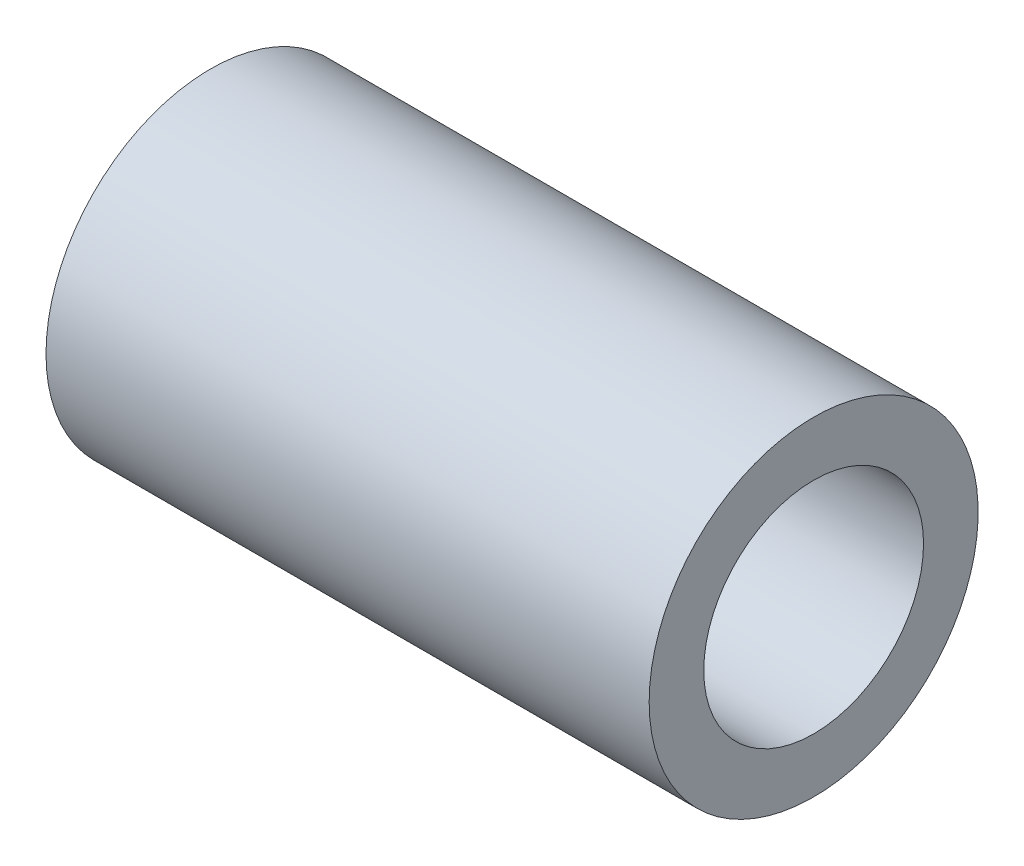
ISO-10303-21;
HEADER;
FILE_DESCRIPTION(('STEP AP214'),'2;1');
FILE_NAME('part.step','',(''),(''),'','','');
FILE_SCHEMA(('AUTOMOTIVE_DESIGN { 1 0 10303 214 1 1 1 1 }'));
ENDSEC;
DATA;
#1=APPLICATION_CONTEXT('core data for automotive mechanical design processes');
#2=APPLICATION_PROTOCOL_DEFINITION('international standard','automotive_design',2000,#1);
#3=PRODUCT_CONTEXT('',#1,'mechanical');
#4=PRODUCT('Part','Part','',(#3));
#5=PRODUCT_RELATED_PRODUCT_CATEGORY('part','',(#4));
#6=PRODUCT_DEFINITION_FORMATION('','',#4);
#7=PRODUCT_DEFINITION_CONTEXT('part definition',#1,'design');
#8=PRODUCT_DEFINITION('design','',#6,#7);
#9=PRODUCT_DEFINITION_SHAPE('','',#8);
#10=(LENGTH_UNIT() NAMED_UNIT(*) SI_UNIT(.MILLI.,.METRE.));
#11=(NAMED_UNIT(*) PLANE_ANGLE_UNIT() SI_UNIT($,.RADIAN.));
#12=(NAMED_UNIT(*) SI_UNIT($,.STERADIAN.) SOLID_ANGLE_UNIT());
#13=UNCERTAINTY_MEASURE_WITH_UNIT(LENGTH_MEASURE(1.E-05),#10,'distance_accuracy_value','');
#14=(GEOMETRIC_REPRESENTATION_CONTEXT(3) GLOBAL_UNCERTAINTY_ASSIGNED_CONTEXT((#13)) GLOBAL_UNIT_ASSIGNED_CONTEXT((#10,
#11,#12)) REPRESENTATION_CONTEXT('',''));
#15=CARTESIAN_POINT('',(0.,0.,0.));
#16=DIRECTION('',(0.,0.,1.));
#17=DIRECTION('',(1.,0.,0.));
#18=AXIS2_PLACEMENT_3D('',#15,#16,#17);
#19=CARTESIAN_POINT('',(0.,9.52500000000001,0.));
#20=DIRECTION('',(1.,0.,0.));
#21=DIRECTION('',(0.,0.,-1.));
#22=AXIS2_PLACEMENT_3D('',#19,#20,#21);
#23=PLANE('',#22);
#24=CARTESIAN_POINT('',(0.,0.,0.));
#25=DIRECTION('',(-1.,0.,0.));
#26=DIRECTION('',(0.,0.,1.));
#27=AXIS2_PLACEMENT_3D('',#24,#25,#26);
#28=CIRCLE('',#27,6.3627);
#29=CARTESIAN_POINT('',(0.,0.,6.36270000000001));
#30=VERTEX_POINT('',#29);
#31=EDGE_CURVE('E10',#30,#30,#28,.T.);
#32=ORIENTED_EDGE('',*,*,#31,.F.);
#33=EDGE_LOOP('',(#32));
#34=FACE_BOUND('',#33,.T.);
#35=CARTESIAN_POINT('',(0.,0.,0.));
#36=DIRECTION('',(-1.,0.,0.));
#37=DIRECTION('',(0.,0.,1.));
#38=AXIS2_PLACEMENT_3D('',#35,#36,#37);
#39=CIRCLE('',#38,9.525);
#40=CARTESIAN_POINT('',(0.,0.,9.52500000000001));
#41=VERTEX_POINT('',#40);
#42=EDGE_CURVE('E36',#41,#41,#39,.T.);
#43=ORIENTED_EDGE('',*,*,#42,.T.);
#44=EDGE_LOOP('',(#43));
#45=FACE_BOUND('',#44,.T.);
#46=ADVANCED_FACE('F22',(#34,#45),#23,.F.);
#47=CARTESIAN_POINT('',(0.,0.,0.));
#48=DIRECTION('',(-1.,0.,0.));
#49=DIRECTION('',(0.,0.,1.));
#50=AXIS2_PLACEMENT_3D('',#47,#48,#49);
#51=CYLINDRICAL_SURFACE('',#50,6.3627);
#52=CARTESIAN_POINT('',(34.925,0.,0.));
#53=DIRECTION('',(-1.,0.,0.));
#54=DIRECTION('',(0.,0.,1.));
#55=AXIS2_PLACEMENT_3D('',#52,#53,#54);
#56=CIRCLE('',#55,6.3627);
#57=CARTESIAN_POINT('',(34.925,0.,6.36270000000001));
#58=VERTEX_POINT('',#57);
#59=EDGE_CURVE('E28',#58,#58,#56,.T.);
#60=ORIENTED_EDGE('',*,*,#59,.F.);
#61=EDGE_LOOP('',(#60));
#62=FACE_BOUND('',#61,.T.);
#63=ORIENTED_EDGE('',*,*,#31,.T.);
#64=EDGE_LOOP('',(#63));
#65=FACE_BOUND('',#64,.T.);
#66=ADVANCED_FACE('F51',(#62,#65),#51,.F.);
#67=CARTESIAN_POINT('',(34.925,9.52500000000001,0.));
#68=DIRECTION('',(-1.,0.,0.));
#69=DIRECTION('',(0.,0.,1.));
#70=AXIS2_PLACEMENT_3D('',#67,#68,#69);
#71=PLANE('',#70);
#72=CARTESIAN_POINT('',(34.925,0.,0.));
#73=DIRECTION('',(-1.,0.,0.));
#74=DIRECTION('',(0.,0.,1.));
#75=AXIS2_PLACEMENT_3D('',#72,#73,#74);
#76=CIRCLE('',#75,9.525);
#77=CARTESIAN_POINT('',(34.925,0.,9.52500000000001));
#78=VERTEX_POINT('',#77);
#79=EDGE_CURVE('E32',#78,#78,#76,.T.);
#80=ORIENTED_EDGE('',*,*,#79,.F.);
#81=EDGE_LOOP('',(#80));
#82=FACE_BOUND('',#81,.T.);
#83=ORIENTED_EDGE('',*,*,#59,.T.);
#84=EDGE_LOOP('',(#83));
#85=FACE_BOUND('',#84,.T.);
#86=ADVANCED_FACE('F46',(#82,#85),#71,.F.);
#87=CARTESIAN_POINT('',(0.,0.,0.));
#88=DIRECTION('',(-1.,0.,0.));
#89=DIRECTION('',(0.,0.,1.));
#90=AXIS2_PLACEMENT_3D('',#87,#88,#89);
#91=CYLINDRICAL_SURFACE('',#90,9.525);
#92=ORIENTED_EDGE('',*,*,#42,.F.);
#93=EDGE_LOOP('',(#92));
#94=FACE_BOUND('',#93,.T.);
#95=ORIENTED_EDGE('',*,*,#79,.T.);
#96=EDGE_LOOP('',(#95));
#97=FACE_BOUND('',#96,.T.);
#98=ADVANCED_FACE('F43',(#94,#97),#91,.T.);
#99=CLOSED_SHELL('',(#46,#66,#86,#98));
#100=MANIFOLD_SOLID_BREP('B2',#99);
#101=ADVANCED_BREP_SHAPE_REPRESENTATION('',(#18,#100),#14);
#102=SHAPE_DEFINITION_REPRESENTATION(#9,#101);
ENDSEC;
END-ISO-10303-21;
